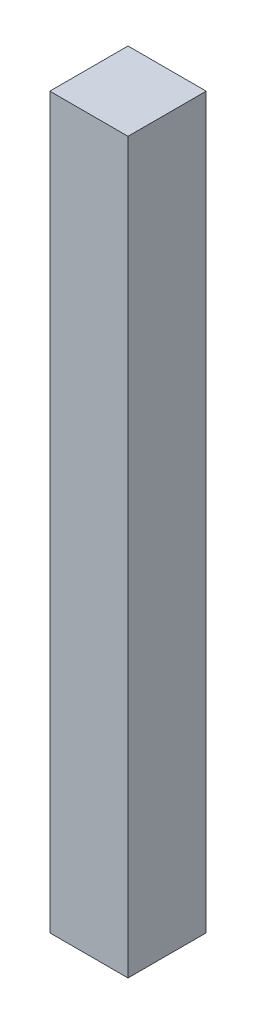
ISO-10303-21;
HEADER;
FILE_DESCRIPTION(('STEP AP214'),'2;1');
FILE_NAME('part.step','',(''),(''),'','','');
FILE_SCHEMA(('AUTOMOTIVE_DESIGN { 1 0 10303 214 1 1 1 1 }'));
ENDSEC;
DATA;
#1=APPLICATION_CONTEXT('core data for automotive mechanical design processes');
#2=APPLICATION_PROTOCOL_DEFINITION('international standard','automotive_design',2000,#1);
#3=PRODUCT_CONTEXT('',#1,'mechanical');
#4=PRODUCT('Part','Part','',(#3));
#5=PRODUCT_RELATED_PRODUCT_CATEGORY('part','',(#4));
#6=PRODUCT_DEFINITION_FORMATION('','',#4);
#7=PRODUCT_DEFINITION_CONTEXT('part definition',#1,'design');
#8=PRODUCT_DEFINITION('design','',#6,#7);
#9=PRODUCT_DEFINITION_SHAPE('','',#8);
#10=(LENGTH_UNIT() NAMED_UNIT(*) SI_UNIT(.MILLI.,.METRE.));
#11=(NAMED_UNIT(*) PLANE_ANGLE_UNIT() SI_UNIT($,.RADIAN.));
#12=(NAMED_UNIT(*) SI_UNIT($,.STERADIAN.) SOLID_ANGLE_UNIT());
#13=UNCERTAINTY_MEASURE_WITH_UNIT(LENGTH_MEASURE(1.E-05),#10,'distance_accuracy_value','');
#14=(GEOMETRIC_REPRESENTATION_CONTEXT(3) GLOBAL_UNCERTAINTY_ASSIGNED_CONTEXT((#13)) GLOBAL_UNIT_ASSIGNED_CONTEXT((#10,
#11,#12)) REPRESENTATION_CONTEXT('',''));
#15=CARTESIAN_POINT('',(0.,0.,0.));
#16=DIRECTION('',(0.,0.,1.));
#17=DIRECTION('',(1.,0.,0.));
#18=AXIS2_PLACEMENT_3D('',#15,#16,#17);
#19=CARTESIAN_POINT('',(-508.,-828.675,-1016.));
#20=DIRECTION('',(1.,0.,0.));
#21=DIRECTION('',(0.,0.,1.));
#22=AXIS2_PLACEMENT_3D('',#19,#20,#21);
#23=PLANE('',#22);
#24=DIRECTION('',(0.,0.,1.));
#25=VECTOR('',#24,1.);
#26=CARTESIAN_POINT('',(-508.,0.,-1016.));
#27=LINE('',#26,#25);
#28=CARTESIAN_POINT('',(-508.,0.,-1016.));
#29=VERTEX_POINT('',#28);
#30=CARTESIAN_POINT('',(-508.,0.,-927.1));
#31=VERTEX_POINT('',#30);
#32=EDGE_CURVE('E95',#29,#31,#27,.T.);
#33=ORIENTED_EDGE('',*,*,#32,.F.);
#34=DIRECTION('',(0.,1.,0.));
#35=VECTOR('',#34,1.);
#36=CARTESIAN_POINT('',(-508.,-828.675,-1016.));
#37=LINE('',#36,#35);
#38=CARTESIAN_POINT('',(-508.,-828.675,-1016.));
#39=VERTEX_POINT('',#38);
#40=EDGE_CURVE('E110',#39,#29,#37,.T.);
#41=ORIENTED_EDGE('',*,*,#40,.F.);
#42=DIRECTION('',(0.,0.,1.));
#43=VECTOR('',#42,1.);
#44=CARTESIAN_POINT('',(-508.,-828.675,-1016.));
#45=LINE('',#44,#43);
#46=CARTESIAN_POINT('',(-508.,-828.675,-927.1));
#47=VERTEX_POINT('',#46);
#48=EDGE_CURVE('E103',#39,#47,#45,.T.);
#49=ORIENTED_EDGE('',*,*,#48,.T.);
#50=DIRECTION('',(0.,1.,0.));
#51=VECTOR('',#50,1.);
#52=CARTESIAN_POINT('',(-508.,-828.675,-927.1));
#53=LINE('',#52,#51);
#54=EDGE_CURVE('E11',#47,#31,#53,.T.);
#55=ORIENTED_EDGE('',*,*,#54,.T.);
#56=EDGE_LOOP('',(#33,#41,#49,#55));
#57=FACE_BOUND('',#56,.T.);
#58=ADVANCED_FACE('F38',(#57),#23,.F.);
#59=CARTESIAN_POINT('',(-508.,-828.675,-927.1));
#60=DIRECTION('',(0.,0.,-1.));
#61=DIRECTION('',(1.,0.,0.));
#62=AXIS2_PLACEMENT_3D('',#59,#60,#61);
#63=PLANE('',#62);
#64=DIRECTION('',(1.,0.,0.));
#65=VECTOR('',#64,1.);
#66=CARTESIAN_POINT('',(-508.,0.,-927.1));
#67=LINE('',#66,#65);
#68=CARTESIAN_POINT('',(-419.1,0.,-927.1));
#69=VERTEX_POINT('',#68);
#70=EDGE_CURVE('E98',#31,#69,#67,.T.);
#71=ORIENTED_EDGE('',*,*,#70,.F.);
#72=ORIENTED_EDGE('',*,*,#54,.F.);
#73=DIRECTION('',(1.,0.,0.));
#74=VECTOR('',#73,1.);
#75=CARTESIAN_POINT('',(-508.,-828.675,-927.1));
#76=LINE('',#75,#74);
#77=CARTESIAN_POINT('',(-419.1,-828.675,-927.1));
#78=VERTEX_POINT('',#77);
#79=EDGE_CURVE('E80',#47,#78,#76,.T.);
#80=ORIENTED_EDGE('',*,*,#79,.T.);
#81=DIRECTION('',(0.,1.,0.));
#82=VECTOR('',#81,1.);
#83=CARTESIAN_POINT('',(-419.1,-828.675,-927.1));
#84=LINE('',#83,#82);
#85=EDGE_CURVE('E46',#78,#69,#84,.T.);
#86=ORIENTED_EDGE('',*,*,#85,.T.);
#87=EDGE_LOOP('',(#71,#72,#80,#86));
#88=FACE_BOUND('',#87,.T.);
#89=ADVANCED_FACE('F122',(#88),#63,.F.);
#90=CARTESIAN_POINT('',(-419.1,-828.675,-1016.));
#91=DIRECTION('',(-1.,0.,0.));
#92=DIRECTION('',(0.,0.,-1.));
#93=AXIS2_PLACEMENT_3D('',#90,#91,#92);
#94=PLANE('',#93);
#95=DIRECTION('',(0.,0.,-1.));
#96=VECTOR('',#95,1.);
#97=CARTESIAN_POINT('',(-419.1,0.,-1016.));
#98=LINE('',#97,#96);
#99=CARTESIAN_POINT('',(-419.1,0.,-1016.));
#100=VERTEX_POINT('',#99);
#101=EDGE_CURVE('E114',#69,#100,#98,.T.);
#102=ORIENTED_EDGE('',*,*,#101,.F.);
#103=ORIENTED_EDGE('',*,*,#85,.F.);
#104=DIRECTION('',(0.,0.,-1.));
#105=VECTOR('',#104,1.);
#106=CARTESIAN_POINT('',(-419.1,-828.675,-1016.));
#107=LINE('',#106,#105);
#108=CARTESIAN_POINT('',(-419.1,-828.675,-1016.));
#109=VERTEX_POINT('',#108);
#110=EDGE_CURVE('E107',#78,#109,#107,.T.);
#111=ORIENTED_EDGE('',*,*,#110,.T.);
#112=DIRECTION('',(0.,1.,0.));
#113=VECTOR('',#112,1.);
#114=CARTESIAN_POINT('',(-419.1,-828.675,-1016.));
#115=LINE('',#114,#113);
#116=EDGE_CURVE('E118',#109,#100,#115,.T.);
#117=ORIENTED_EDGE('',*,*,#116,.T.);
#118=EDGE_LOOP('',(#102,#103,#111,#117));
#119=FACE_BOUND('',#118,.T.);
#120=ADVANCED_FACE('F129',(#119),#94,.F.);
#121=CARTESIAN_POINT('',(-508.,-828.675,-1016.));
#122=DIRECTION('',(0.,0.,1.));
#123=DIRECTION('',(-1.,0.,0.));
#124=AXIS2_PLACEMENT_3D('',#121,#122,#123);
#125=PLANE('',#124);
#126=DIRECTION('',(-1.,0.,0.));
#127=VECTOR('',#126,1.);
#128=CARTESIAN_POINT('',(-508.,0.,-1016.));
#129=LINE('',#128,#127);
#130=EDGE_CURVE('E69',#100,#29,#129,.T.);
#131=ORIENTED_EDGE('',*,*,#130,.F.);
#132=ORIENTED_EDGE('',*,*,#116,.F.);
#133=DIRECTION('',(-1.,0.,0.));
#134=VECTOR('',#133,1.);
#135=CARTESIAN_POINT('',(-508.,-828.675,-1016.));
#136=LINE('',#135,#134);
#137=EDGE_CURVE('E54',#109,#39,#136,.T.);
#138=ORIENTED_EDGE('',*,*,#137,.T.);
#139=ORIENTED_EDGE('',*,*,#40,.T.);
#140=EDGE_LOOP('',(#131,#132,#138,#139));
#141=FACE_BOUND('',#140,.T.);
#142=ADVANCED_FACE('F128',(#141),#125,.F.);
#143=CARTESIAN_POINT('',(0.,-828.675,0.));
#144=DIRECTION('',(0.,-1.,0.));
#145=DIRECTION('',(0.,0.,1.));
#146=AXIS2_PLACEMENT_3D('',#143,#144,#145);
#147=PLANE('',#146);
#148=CARTESIAN_POINT('',(-463.55,-828.675,-971.55));
#149=DIRECTION('',(0.,1.,0.));
#150=DIRECTION('',(0.,0.,1.));
#151=AXIS2_PLACEMENT_3D('',#148,#149,#150);
#152=CIRCLE('',#151,6.35000000000002);
#153=CARTESIAN_POINT('',(-463.55,-828.675,-965.2));
#154=VERTEX_POINT('',#153);
#155=EDGE_CURVE('E96',#154,#154,#152,.T.);
#156=ORIENTED_EDGE('',*,*,#155,.T.);
#157=EDGE_LOOP('',(#156));
#158=FACE_BOUND('',#157,.T.);
#159=ORIENTED_EDGE('',*,*,#48,.F.);
#160=ORIENTED_EDGE('',*,*,#137,.F.);
#161=ORIENTED_EDGE('',*,*,#110,.F.);
#162=ORIENTED_EDGE('',*,*,#79,.F.);
#163=EDGE_LOOP('',(#159,#160,#161,#162));
#164=FACE_BOUND('',#163,.T.);
#165=ADVANCED_FACE('F127',(#158,#164),#147,.T.);
#166=CARTESIAN_POINT('',(0.,0.,0.));
#167=DIRECTION('',(0.,-1.,0.));
#168=DIRECTION('',(0.,0.,1.));
#169=AXIS2_PLACEMENT_3D('',#166,#167,#168);
#170=PLANE('',#169);
#171=ORIENTED_EDGE('',*,*,#32,.T.);
#172=ORIENTED_EDGE('',*,*,#70,.T.);
#173=ORIENTED_EDGE('',*,*,#101,.T.);
#174=ORIENTED_EDGE('',*,*,#130,.T.);
#175=EDGE_LOOP('',(#171,#172,#173,#174));
#176=FACE_BOUND('',#175,.T.);
#177=ADVANCED_FACE('F89',(#176),#170,.F.);
#178=CARTESIAN_POINT('',(-463.55,-824.611,-971.55));
#179=DIRECTION('',(0.,-1.,0.));
#180=DIRECTION('',(0.,0.,1.));
#181=AXIS2_PLACEMENT_3D('',#178,#179,#180);
#182=CONICAL_SURFACE('',#181,6.35000000000002,1.02974425867665);
#183=CARTESIAN_POINT('',(-463.55,-820.795535069175,-971.55));
#184=VERTEX_POINT('',#183);
#185=VERTEX_LOOP('',#184);
#186=FACE_BOUND('',#185,.T.);
#187=CARTESIAN_POINT('',(-463.55,-824.611,-971.55));
#188=DIRECTION('',(0.,1.,0.));
#189=DIRECTION('',(0.,0.,1.));
#190=AXIS2_PLACEMENT_3D('',#187,#188,#189);
#191=CIRCLE('',#190,6.35000000000002);
#192=CARTESIAN_POINT('',(-463.55,-824.611,-965.2));
#193=VERTEX_POINT('',#192);
#194=EDGE_CURVE('E93',#193,#193,#191,.T.);
#195=ORIENTED_EDGE('',*,*,#194,.F.);
#196=EDGE_LOOP('',(#195));
#197=FACE_BOUND('',#196,.T.);
#198=ADVANCED_FACE('F85',(#186,#197),#182,.F.);
#199=CARTESIAN_POINT('',(-463.55,-828.675,-971.55));
#200=DIRECTION('',(0.,-1.,0.));
#201=DIRECTION('',(0.,0.,1.));
#202=AXIS2_PLACEMENT_3D('',#199,#200,#201);
#203=CYLINDRICAL_SURFACE('',#202,6.35000000000002);
#204=ORIENTED_EDGE('',*,*,#194,.T.);
#205=EDGE_LOOP('',(#204));
#206=FACE_BOUND('',#205,.T.);
#207=ORIENTED_EDGE('',*,*,#155,.F.);
#208=EDGE_LOOP('',(#207));
#209=FACE_BOUND('',#208,.T.);
#210=ADVANCED_FACE('F88',(#206,#209),#203,.F.);
#211=CLOSED_SHELL('',(#58,#89,#120,#142,#165,#177,#198,#210));
#212=MANIFOLD_SOLID_BREP('B2',#211);
#213=ADVANCED_BREP_SHAPE_REPRESENTATION('',(#18,#212),#14);
#214=SHAPE_DEFINITION_REPRESENTATION(#9,#213);
ENDSEC;
END-ISO-10303-21;
